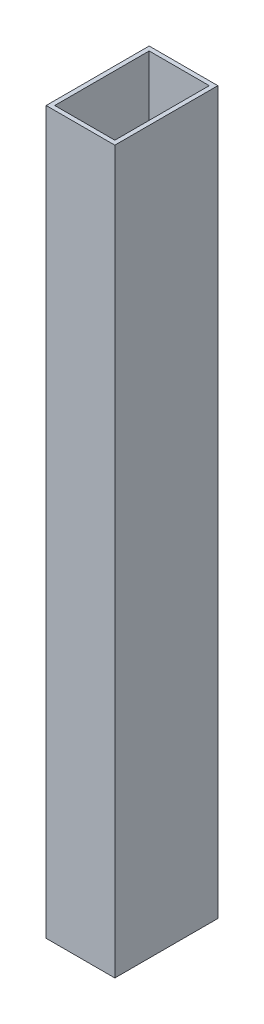
ISO-10303-21;
HEADER;
FILE_DESCRIPTION(('STEP AP214'),'2;1');
FILE_NAME('part.step','',(''),(''),'','','');
FILE_SCHEMA(('AUTOMOTIVE_DESIGN { 1 0 10303 214 1 1 1 1 }'));
ENDSEC;
DATA;
#1=APPLICATION_CONTEXT('core data for automotive mechanical design processes');
#2=APPLICATION_PROTOCOL_DEFINITION('international standard','automotive_design',2000,#1);
#3=PRODUCT_CONTEXT('',#1,'mechanical');
#4=PRODUCT('Part','Part','',(#3));
#5=PRODUCT_RELATED_PRODUCT_CATEGORY('part','',(#4));
#6=PRODUCT_DEFINITION_FORMATION('','',#4);
#7=PRODUCT_DEFINITION_CONTEXT('part definition',#1,'design');
#8=PRODUCT_DEFINITION('design','',#6,#7);
#9=PRODUCT_DEFINITION_SHAPE('','',#8);
#10=(LENGTH_UNIT() NAMED_UNIT(*) SI_UNIT(.MILLI.,.METRE.));
#11=(NAMED_UNIT(*) PLANE_ANGLE_UNIT() SI_UNIT($,.RADIAN.));
#12=(NAMED_UNIT(*) SI_UNIT($,.STERADIAN.) SOLID_ANGLE_UNIT());
#13=UNCERTAINTY_MEASURE_WITH_UNIT(LENGTH_MEASURE(1.E-05),#10,'distance_accuracy_value','');
#14=(GEOMETRIC_REPRESENTATION_CONTEXT(3) GLOBAL_UNCERTAINTY_ASSIGNED_CONTEXT((#13)) GLOBAL_UNIT_ASSIGNED_CONTEXT((#10,
#11,#12)) REPRESENTATION_CONTEXT('',''));
#15=CARTESIAN_POINT('',(0.,0.,0.));
#16=DIRECTION('',(0.,0.,1.));
#17=DIRECTION('',(1.,0.,0.));
#18=AXIS2_PLACEMENT_3D('',#15,#16,#17);
#19=CARTESIAN_POINT('',(25.4,-533.4,38.1));
#20=DIRECTION('',(0.,-1.,0.));
#21=DIRECTION('',(1.,0.,0.));
#22=AXIS2_PLACEMENT_3D('',#19,#20,#21);
#23=PLANE('',#22);
#24=DIRECTION('',(0.,0.,1.));
#25=VECTOR('',#24,1.);
#26=CARTESIAN_POINT('',(0.,-533.4,38.1));
#27=LINE('',#26,#25);
#28=CARTESIAN_POINT('',(0.,-533.4,0.));
#29=VERTEX_POINT('',#28);
#30=CARTESIAN_POINT('',(0.,-533.4,76.2));
#31=VERTEX_POINT('',#30);
#32=EDGE_CURVE('E144',#29,#31,#27,.T.);
#33=ORIENTED_EDGE('',*,*,#32,.F.);
#34=DIRECTION('',(1.,0.,0.));
#35=VECTOR('',#34,1.);
#36=CARTESIAN_POINT('',(25.4,-533.4,0.));
#37=LINE('',#36,#35);
#38=CARTESIAN_POINT('',(50.8,-533.4,0.));
#39=VERTEX_POINT('',#38);
#40=EDGE_CURVE('E148',#29,#39,#37,.T.);
#41=ORIENTED_EDGE('',*,*,#40,.T.);
#42=DIRECTION('',(0.,0.,1.));
#43=VECTOR('',#42,1.);
#44=CARTESIAN_POINT('',(50.8,-533.4,38.1));
#45=LINE('',#44,#43);
#46=CARTESIAN_POINT('',(50.8,-533.4,76.2));
#47=VERTEX_POINT('',#46);
#48=EDGE_CURVE('E152',#39,#47,#45,.T.);
#49=ORIENTED_EDGE('',*,*,#48,.T.);
#50=DIRECTION('',(1.,0.,0.));
#51=VECTOR('',#50,1.);
#52=CARTESIAN_POINT('',(25.4,-533.4,76.2));
#53=LINE('',#52,#51);
#54=EDGE_CURVE('E155',#31,#47,#53,.T.);
#55=ORIENTED_EDGE('',*,*,#54,.F.);
#56=EDGE_LOOP('',(#33,#41,#49,#55));
#57=FACE_BOUND('',#56,.T.);
#58=DIRECTION('',(1.,0.,0.));
#59=VECTOR('',#58,1.);
#60=CARTESIAN_POINT('',(25.4,-533.4,3.175));
#61=LINE('',#60,#59);
#62=CARTESIAN_POINT('',(3.175,-533.4,3.175));
#63=VERTEX_POINT('',#62);
#64=CARTESIAN_POINT('',(47.625,-533.4,3.175));
#65=VERTEX_POINT('',#64);
#66=EDGE_CURVE('E131',#63,#65,#61,.T.);
#67=ORIENTED_EDGE('',*,*,#66,.F.);
#68=DIRECTION('',(0.,0.,1.));
#69=VECTOR('',#68,1.);
#70=CARTESIAN_POINT('',(3.175,-533.4,38.1));
#71=LINE('',#70,#69);
#72=CARTESIAN_POINT('',(3.175,-533.4,73.025));
#73=VERTEX_POINT('',#72);
#74=EDGE_CURVE('E125',#63,#73,#71,.T.);
#75=ORIENTED_EDGE('',*,*,#74,.T.);
#76=DIRECTION('',(1.,0.,0.));
#77=VECTOR('',#76,1.);
#78=CARTESIAN_POINT('',(25.4,-533.4,73.025));
#79=LINE('',#78,#77);
#80=CARTESIAN_POINT('',(47.625,-533.4,73.025));
#81=VERTEX_POINT('',#80);
#82=EDGE_CURVE('E107',#73,#81,#79,.T.);
#83=ORIENTED_EDGE('',*,*,#82,.T.);
#84=DIRECTION('',(0.,0.,1.));
#85=VECTOR('',#84,1.);
#86=CARTESIAN_POINT('',(47.625,-533.4,38.1));
#87=LINE('',#86,#85);
#88=EDGE_CURVE('E140',#65,#81,#87,.T.);
#89=ORIENTED_EDGE('',*,*,#88,.F.);
#90=EDGE_LOOP('',(#67,#75,#83,#89));
#91=FACE_BOUND('',#90,.T.);
#92=ADVANCED_FACE('F16',(#57,#91),#23,.T.);
#93=CARTESIAN_POINT('',(25.4,0.,38.1));
#94=DIRECTION('',(0.,-1.,0.));
#95=DIRECTION('',(1.,0.,0.));
#96=AXIS2_PLACEMENT_3D('',#93,#94,#95);
#97=PLANE('',#96);
#98=DIRECTION('',(0.,0.,1.));
#99=VECTOR('',#98,1.);
#100=CARTESIAN_POINT('',(0.,0.,38.1));
#101=LINE('',#100,#99);
#102=CARTESIAN_POINT('',(0.,0.,0.));
#103=VERTEX_POINT('',#102);
#104=CARTESIAN_POINT('',(0.,0.,76.2));
#105=VERTEX_POINT('',#104);
#106=EDGE_CURVE('E160',#103,#105,#101,.T.);
#107=ORIENTED_EDGE('',*,*,#106,.T.);
#108=DIRECTION('',(1.,0.,0.));
#109=VECTOR('',#108,1.);
#110=CARTESIAN_POINT('',(25.4,0.,76.2));
#111=LINE('',#110,#109);
#112=CARTESIAN_POINT('',(50.8,0.,76.2));
#113=VERTEX_POINT('',#112);
#114=EDGE_CURVE('E149',#105,#113,#111,.T.);
#115=ORIENTED_EDGE('',*,*,#114,.T.);
#116=DIRECTION('',(0.,0.,1.));
#117=VECTOR('',#116,1.);
#118=CARTESIAN_POINT('',(50.8,0.,38.1));
#119=LINE('',#118,#117);
#120=CARTESIAN_POINT('',(50.8,0.,0.));
#121=VERTEX_POINT('',#120);
#122=EDGE_CURVE('E167',#121,#113,#119,.T.);
#123=ORIENTED_EDGE('',*,*,#122,.F.);
#124=DIRECTION('',(1.,0.,0.));
#125=VECTOR('',#124,1.);
#126=CARTESIAN_POINT('',(25.4,0.,0.));
#127=LINE('',#126,#125);
#128=EDGE_CURVE('E164',#103,#121,#127,.T.);
#129=ORIENTED_EDGE('',*,*,#128,.F.);
#130=EDGE_LOOP('',(#107,#115,#123,#129));
#131=FACE_BOUND('',#130,.T.);
#132=DIRECTION('',(0.,0.,1.));
#133=VECTOR('',#132,1.);
#134=CARTESIAN_POINT('',(3.175,0.,38.1));
#135=LINE('',#134,#133);
#136=CARTESIAN_POINT('',(3.175,0.,3.175));
#137=VERTEX_POINT('',#136);
#138=CARTESIAN_POINT('',(3.175,0.,73.025));
#139=VERTEX_POINT('',#138);
#140=EDGE_CURVE('E114',#137,#139,#135,.T.);
#141=ORIENTED_EDGE('',*,*,#140,.F.);
#142=DIRECTION('',(1.,0.,0.));
#143=VECTOR('',#142,1.);
#144=CARTESIAN_POINT('',(25.4,0.,3.175));
#145=LINE('',#144,#143);
#146=CARTESIAN_POINT('',(47.625,0.,3.175));
#147=VERTEX_POINT('',#146);
#148=EDGE_CURVE('E121',#137,#147,#145,.T.);
#149=ORIENTED_EDGE('',*,*,#148,.T.);
#150=DIRECTION('',(0.,0.,1.));
#151=VECTOR('',#150,1.);
#152=CARTESIAN_POINT('',(47.625,0.,38.1));
#153=LINE('',#152,#151);
#154=CARTESIAN_POINT('',(47.625,0.,73.025));
#155=VERTEX_POINT('',#154);
#156=EDGE_CURVE('E48',#147,#155,#153,.T.);
#157=ORIENTED_EDGE('',*,*,#156,.T.);
#158=DIRECTION('',(1.,0.,0.));
#159=VECTOR('',#158,1.);
#160=CARTESIAN_POINT('',(25.4,0.,73.025));
#161=LINE('',#160,#159);
#162=EDGE_CURVE('E105',#139,#155,#161,.T.);
#163=ORIENTED_EDGE('',*,*,#162,.F.);
#164=EDGE_LOOP('',(#141,#149,#157,#163));
#165=FACE_BOUND('',#164,.T.);
#166=ADVANCED_FACE('F123',(#131,#165),#97,.F.);
#167=CARTESIAN_POINT('',(0.,-533.4,38.1));
#168=DIRECTION('',(-1.,0.,0.));
#169=DIRECTION('',(0.,0.,1.));
#170=AXIS2_PLACEMENT_3D('',#167,#168,#169);
#171=PLANE('',#170);
#172=ORIENTED_EDGE('',*,*,#106,.F.);
#173=DIRECTION('',(0.,1.,0.));
#174=VECTOR('',#173,1.);
#175=CARTESIAN_POINT('',(0.,-533.4,0.));
#176=LINE('',#175,#174);
#177=EDGE_CURVE('E11',#29,#103,#176,.T.);
#178=ORIENTED_EDGE('',*,*,#177,.F.);
#179=ORIENTED_EDGE('',*,*,#32,.T.);
#180=DIRECTION('',(0.,1.,0.));
#181=VECTOR('',#180,1.);
#182=CARTESIAN_POINT('',(0.,-533.4,76.2));
#183=LINE('',#182,#181);
#184=EDGE_CURVE('E159',#31,#105,#183,.T.);
#185=ORIENTED_EDGE('',*,*,#184,.T.);
#186=EDGE_LOOP('',(#172,#178,#179,#185));
#187=FACE_BOUND('',#186,.T.);
#188=ADVANCED_FACE('F18',(#187),#171,.T.);
#189=CARTESIAN_POINT('',(25.4,-533.4,0.));
#190=DIRECTION('',(0.,0.,1.));
#191=DIRECTION('',(1.,0.,0.));
#192=AXIS2_PLACEMENT_3D('',#189,#190,#191);
#193=PLANE('',#192);
#194=ORIENTED_EDGE('',*,*,#128,.T.);
#195=DIRECTION('',(0.,1.,0.));
#196=VECTOR('',#195,1.);
#197=CARTESIAN_POINT('',(50.8,-533.4,0.));
#198=LINE('',#197,#196);
#199=EDGE_CURVE('E25',#39,#121,#198,.T.);
#200=ORIENTED_EDGE('',*,*,#199,.F.);
#201=ORIENTED_EDGE('',*,*,#40,.F.);
#202=ORIENTED_EDGE('',*,*,#177,.T.);
#203=EDGE_LOOP('',(#194,#200,#201,#202));
#204=FACE_BOUND('',#203,.T.);
#205=ADVANCED_FACE('F199',(#204),#193,.F.);
#206=CARTESIAN_POINT('',(50.8,-533.4,38.1));
#207=DIRECTION('',(-1.,0.,0.));
#208=DIRECTION('',(0.,0.,1.));
#209=AXIS2_PLACEMENT_3D('',#206,#207,#208);
#210=PLANE('',#209);
#211=ORIENTED_EDGE('',*,*,#122,.T.);
#212=DIRECTION('',(0.,1.,0.));
#213=VECTOR('',#212,1.);
#214=CARTESIAN_POINT('',(50.8,-533.4,76.2));
#215=LINE('',#214,#213);
#216=EDGE_CURVE('E176',#47,#113,#215,.T.);
#217=ORIENTED_EDGE('',*,*,#216,.F.);
#218=ORIENTED_EDGE('',*,*,#48,.F.);
#219=ORIENTED_EDGE('',*,*,#199,.T.);
#220=EDGE_LOOP('',(#211,#217,#218,#219));
#221=FACE_BOUND('',#220,.T.);
#222=ADVANCED_FACE('F185',(#221),#210,.F.);
#223=CARTESIAN_POINT('',(25.4,-533.4,76.2));
#224=DIRECTION('',(0.,0.,1.));
#225=DIRECTION('',(1.,0.,0.));
#226=AXIS2_PLACEMENT_3D('',#223,#224,#225);
#227=PLANE('',#226);
#228=ORIENTED_EDGE('',*,*,#114,.F.);
#229=ORIENTED_EDGE('',*,*,#184,.F.);
#230=ORIENTED_EDGE('',*,*,#54,.T.);
#231=ORIENTED_EDGE('',*,*,#216,.T.);
#232=EDGE_LOOP('',(#228,#229,#230,#231));
#233=FACE_BOUND('',#232,.T.);
#234=ADVANCED_FACE('F194',(#233),#227,.T.);
#235=CARTESIAN_POINT('',(3.175,-533.4,38.1));
#236=DIRECTION('',(-1.,0.,0.));
#237=DIRECTION('',(0.,0.,1.));
#238=AXIS2_PLACEMENT_3D('',#235,#236,#237);
#239=PLANE('',#238);
#240=ORIENTED_EDGE('',*,*,#140,.T.);
#241=DIRECTION('',(0.,1.,0.));
#242=VECTOR('',#241,1.);
#243=CARTESIAN_POINT('',(3.175,-533.4,73.025));
#244=LINE('',#243,#242);
#245=EDGE_CURVE('E101',#73,#139,#244,.T.);
#246=ORIENTED_EDGE('',*,*,#245,.F.);
#247=ORIENTED_EDGE('',*,*,#74,.F.);
#248=DIRECTION('',(0.,1.,0.));
#249=VECTOR('',#248,1.);
#250=CARTESIAN_POINT('',(3.175,-533.4,3.175));
#251=LINE('',#250,#249);
#252=EDGE_CURVE('E116',#63,#137,#251,.T.);
#253=ORIENTED_EDGE('',*,*,#252,.T.);
#254=EDGE_LOOP('',(#240,#246,#247,#253));
#255=FACE_BOUND('',#254,.T.);
#256=ADVANCED_FACE('F115',(#255),#239,.F.);
#257=CARTESIAN_POINT('',(25.4,-533.4,3.175));
#258=DIRECTION('',(0.,0.,1.));
#259=DIRECTION('',(1.,0.,0.));
#260=AXIS2_PLACEMENT_3D('',#257,#258,#259);
#261=PLANE('',#260);
#262=ORIENTED_EDGE('',*,*,#148,.F.);
#263=ORIENTED_EDGE('',*,*,#252,.F.);
#264=ORIENTED_EDGE('',*,*,#66,.T.);
#265=DIRECTION('',(0.,1.,0.));
#266=VECTOR('',#265,1.);
#267=CARTESIAN_POINT('',(47.625,-533.4,3.175));
#268=LINE('',#267,#266);
#269=EDGE_CURVE('E369',#65,#147,#268,.T.);
#270=ORIENTED_EDGE('',*,*,#269,.T.);
#271=EDGE_LOOP('',(#262,#263,#264,#270));
#272=FACE_BOUND('',#271,.T.);
#273=ADVANCED_FACE('F234',(#272),#261,.T.);
#274=CARTESIAN_POINT('',(47.625,-533.4,38.1));
#275=DIRECTION('',(-1.,0.,0.));
#276=DIRECTION('',(0.,0.,1.));
#277=AXIS2_PLACEMENT_3D('',#274,#275,#276);
#278=PLANE('',#277);
#279=ORIENTED_EDGE('',*,*,#156,.F.);
#280=ORIENTED_EDGE('',*,*,#269,.F.);
#281=ORIENTED_EDGE('',*,*,#88,.T.);
#282=DIRECTION('',(0.,1.,0.));
#283=VECTOR('',#282,1.);
#284=CARTESIAN_POINT('',(47.625,-533.4,73.025));
#285=LINE('',#284,#283);
#286=EDGE_CURVE('E37',#81,#155,#285,.T.);
#287=ORIENTED_EDGE('',*,*,#286,.T.);
#288=EDGE_LOOP('',(#279,#280,#281,#287));
#289=FACE_BOUND('',#288,.T.);
#290=ADVANCED_FACE('F241',(#289),#278,.T.);
#291=CARTESIAN_POINT('',(25.4,-533.4,73.025));
#292=DIRECTION('',(0.,0.,1.));
#293=DIRECTION('',(1.,0.,0.));
#294=AXIS2_PLACEMENT_3D('',#291,#292,#293);
#295=PLANE('',#294);
#296=ORIENTED_EDGE('',*,*,#162,.T.);
#297=ORIENTED_EDGE('',*,*,#286,.F.);
#298=ORIENTED_EDGE('',*,*,#82,.F.);
#299=ORIENTED_EDGE('',*,*,#245,.T.);
#300=EDGE_LOOP('',(#296,#297,#298,#299));
#301=FACE_BOUND('',#300,.T.);
#302=ADVANCED_FACE('F103',(#301),#295,.F.);
#303=CLOSED_SHELL('',(#92,#166,#188,#205,#222,#234,#256,#273,#290,#302));
#304=MANIFOLD_SOLID_BREP('B1',#303);
#305=ADVANCED_BREP_SHAPE_REPRESENTATION('',(#18,#304),#14);
#306=SHAPE_DEFINITION_REPRESENTATION(#9,#305);
ENDSEC;
END-ISO-10303-21;
